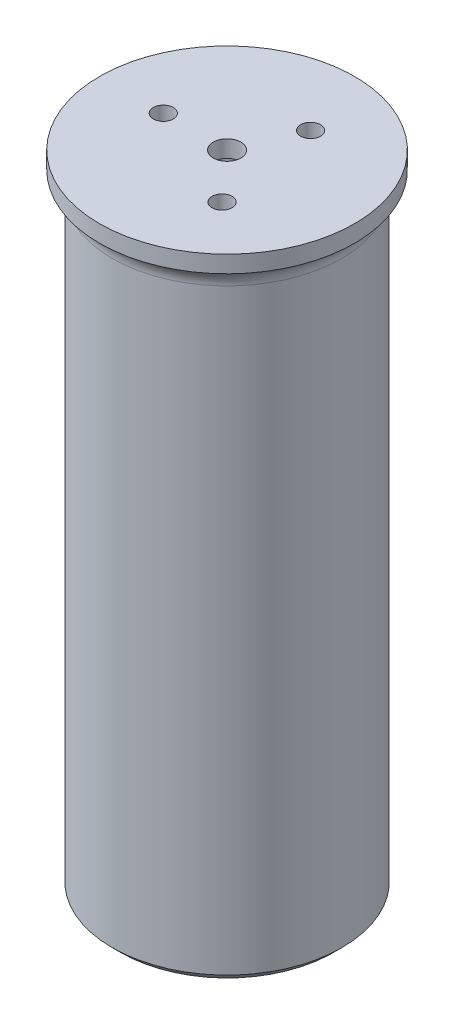
ISO-10303-21;
HEADER;
FILE_DESCRIPTION(('STEP AP214'),'2;1');
FILE_NAME('part.step','',(''),(''),'','','');
FILE_SCHEMA(('AUTOMOTIVE_DESIGN { 1 0 10303 214 1 1 1 1 }'));
ENDSEC;
DATA;
#1=APPLICATION_CONTEXT('core data for automotive mechanical design processes');
#2=APPLICATION_PROTOCOL_DEFINITION('international standard','automotive_design',2000,#1);
#3=PRODUCT_CONTEXT('',#1,'mechanical');
#4=PRODUCT('Part','Part','',(#3));
#5=PRODUCT_RELATED_PRODUCT_CATEGORY('part','',(#4));
#6=PRODUCT_DEFINITION_FORMATION('','',#4);
#7=PRODUCT_DEFINITION_CONTEXT('part definition',#1,'design');
#8=PRODUCT_DEFINITION('design','',#6,#7);
#9=PRODUCT_DEFINITION_SHAPE('','',#8);
#10=(LENGTH_UNIT() NAMED_UNIT(*) SI_UNIT(.MILLI.,.METRE.));
#11=(NAMED_UNIT(*) PLANE_ANGLE_UNIT() SI_UNIT($,.RADIAN.));
#12=(NAMED_UNIT(*) SI_UNIT($,.STERADIAN.) SOLID_ANGLE_UNIT());
#13=UNCERTAINTY_MEASURE_WITH_UNIT(LENGTH_MEASURE(1.E-05),#10,'distance_accuracy_value','');
#14=(GEOMETRIC_REPRESENTATION_CONTEXT(3) GLOBAL_UNCERTAINTY_ASSIGNED_CONTEXT((#13)) GLOBAL_UNIT_ASSIGNED_CONTEXT((#10,
#11,#12)) REPRESENTATION_CONTEXT('',''));
#15=CARTESIAN_POINT('',(0.,0.,0.));
#16=DIRECTION('',(0.,0.,1.));
#17=DIRECTION('',(1.,0.,0.));
#18=AXIS2_PLACEMENT_3D('',#15,#16,#17);
#19=CARTESIAN_POINT('',(0.,0.,0.));
#20=DIRECTION('',(0.,1.,0.));
#21=DIRECTION('',(0.,0.,1.));
#22=AXIS2_PLACEMENT_3D('',#19,#20,#21);
#23=PLANE('',#22);
#24=CARTESIAN_POINT('',(10.,0.,11.1803398874989));
#25=DIRECTION('',(0.,1.,0.));
#26=DIRECTION('',(0.,0.,1.));
#27=AXIS2_PLACEMENT_3D('',#24,#25,#26);
#28=CIRCLE('',#27,2.35);
#29=CARTESIAN_POINT('',(10.,0.,13.5303398874989));
#30=VERTEX_POINT('',#29);
#31=EDGE_CURVE('E66',#30,#30,#28,.T.);
#32=ORIENTED_EDGE('',*,*,#31,.T.);
#33=EDGE_LOOP('',(#32));
#34=FACE_BOUND('',#33,.T.);
#35=CARTESIAN_POINT('',(5.83240896842353,0.,-13.8196601125011));
#36=DIRECTION('',(0.,1.,0.));
#37=DIRECTION('',(0.,0.,1.));
#38=AXIS2_PLACEMENT_3D('',#35,#36,#37);
#39=CIRCLE('',#38,2.35);
#40=CARTESIAN_POINT('',(5.83240896842353,0.,-11.4696601125011));
#41=VERTEX_POINT('',#40);
#42=EDGE_CURVE('E60',#41,#41,#39,.T.);
#43=ORIENTED_EDGE('',*,*,#42,.T.);
#44=EDGE_LOOP('',(#43));
#45=FACE_BOUND('',#44,.T.);
#46=CARTESIAN_POINT('',(-15.,0.,0.00100327868052491));
#47=DIRECTION('',(0.,1.,0.));
#48=DIRECTION('',(0.,0.,1.));
#49=AXIS2_PLACEMENT_3D('',#46,#47,#48);
#50=CIRCLE('',#49,2.35);
#51=CARTESIAN_POINT('',(-15.,0.,2.35100327868052));
#52=VERTEX_POINT('',#51);
#53=EDGE_CURVE('E54',#52,#52,#50,.T.);
#54=ORIENTED_EDGE('',*,*,#53,.T.);
#55=EDGE_LOOP('',(#54));
#56=FACE_BOUND('',#55,.T.);
#57=CARTESIAN_POINT('',(0.,0.,0.));
#58=DIRECTION('',(0.,1.,0.));
#59=DIRECTION('',(0.,0.,1.));
#60=AXIS2_PLACEMENT_3D('',#57,#58,#59);
#61=CIRCLE('',#60,3.25);
#62=CARTESIAN_POINT('',(0.,0.,3.25));
#63=VERTEX_POINT('',#62);
#64=EDGE_CURVE('E69',#63,#63,#61,.T.);
#65=ORIENTED_EDGE('',*,*,#64,.T.);
#66=EDGE_LOOP('',(#65));
#67=FACE_BOUND('',#66,.T.);
#68=CARTESIAN_POINT('',(0.,0.,0.));
#69=DIRECTION('',(0.,-1.,0.));
#70=DIRECTION('',(0.,0.,-1.));
#71=AXIS2_PLACEMENT_3D('',#68,#69,#70);
#72=CIRCLE('',#71,25.);
#73=CARTESIAN_POINT('',(0.,0.,-25.));
#74=VERTEX_POINT('',#73);
#75=EDGE_CURVE('E75',#74,#74,#72,.T.);
#76=ORIENTED_EDGE('',*,*,#75,.T.);
#77=EDGE_LOOP('',(#76));
#78=FACE_BOUND('',#77,.T.);
#79=ADVANCED_FACE('F30',(#34,#45,#56,#67,#78),#23,.F.);
#80=CARTESIAN_POINT('',(0.,4.,0.));
#81=DIRECTION('',(0.,1.,0.));
#82=DIRECTION('',(0.,0.,1.));
#83=AXIS2_PLACEMENT_3D('',#80,#81,#82);
#84=PLANE('',#83);
#85=CARTESIAN_POINT('',(0.,4.,0.));
#86=DIRECTION('',(0.,1.,0.));
#87=DIRECTION('',(0.,0.,1.));
#88=AXIS2_PLACEMENT_3D('',#85,#86,#87);
#89=CIRCLE('',#88,3.25);
#90=CARTESIAN_POINT('',(0.,4.,3.25));
#91=VERTEX_POINT('',#90);
#92=EDGE_CURVE('E72',#91,#91,#89,.T.);
#93=ORIENTED_EDGE('',*,*,#92,.F.);
#94=EDGE_LOOP('',(#93));
#95=FACE_BOUND('',#94,.T.);
#96=CARTESIAN_POINT('',(5.83240896842353,4.,-13.8196601125011));
#97=DIRECTION('',(0.,1.,0.));
#98=DIRECTION('',(0.,0.,1.));
#99=AXIS2_PLACEMENT_3D('',#96,#97,#98);
#100=CIRCLE('',#99,2.35);
#101=CARTESIAN_POINT('',(5.83240896842353,4.,-11.4696601125011));
#102=VERTEX_POINT('',#101);
#103=EDGE_CURVE('E57',#102,#102,#100,.T.);
#104=ORIENTED_EDGE('',*,*,#103,.F.);
#105=EDGE_LOOP('',(#104));
#106=FACE_BOUND('',#105,.T.);
#107=CARTESIAN_POINT('',(0.,4.,0.));
#108=DIRECTION('',(0.,1.,0.));
#109=DIRECTION('',(0.,0.,1.));
#110=AXIS2_PLACEMENT_3D('',#107,#108,#109);
#111=CIRCLE('',#110,30.);
#112=CARTESIAN_POINT('',(0.,4.,30.));
#113=VERTEX_POINT('',#112);
#114=EDGE_CURVE('E45',#113,#113,#111,.T.);
#115=ORIENTED_EDGE('',*,*,#114,.T.);
#116=EDGE_LOOP('',(#115));
#117=FACE_BOUND('',#116,.T.);
#118=CARTESIAN_POINT('',(-15.,4.,0.00100327868052491));
#119=DIRECTION('',(0.,1.,0.));
#120=DIRECTION('',(0.,0.,1.));
#121=AXIS2_PLACEMENT_3D('',#118,#119,#120);
#122=CIRCLE('',#121,2.35);
#123=CARTESIAN_POINT('',(-15.,4.,2.35100327868052));
#124=VERTEX_POINT('',#123);
#125=EDGE_CURVE('E51',#124,#124,#122,.T.);
#126=ORIENTED_EDGE('',*,*,#125,.F.);
#127=EDGE_LOOP('',(#126));
#128=FACE_BOUND('',#127,.T.);
#129=CARTESIAN_POINT('',(10.,4.,11.1803398874989));
#130=DIRECTION('',(0.,1.,0.));
#131=DIRECTION('',(0.,0.,1.));
#132=AXIS2_PLACEMENT_3D('',#129,#130,#131);
#133=CIRCLE('',#132,2.35);
#134=CARTESIAN_POINT('',(10.,4.,13.5303398874989));
#135=VERTEX_POINT('',#134);
#136=EDGE_CURVE('E63',#135,#135,#133,.T.);
#137=ORIENTED_EDGE('',*,*,#136,.F.);
#138=EDGE_LOOP('',(#137));
#139=FACE_BOUND('',#138,.T.);
#140=ADVANCED_FACE('F96',(#95,#106,#117,#128,#139),#84,.T.);
#141=CARTESIAN_POINT('',(0.,4.,0.));
#142=DIRECTION('',(0.,-1.,0.));
#143=DIRECTION('',(0.,0.,-1.));
#144=AXIS2_PLACEMENT_3D('',#141,#142,#143);
#145=CYLINDRICAL_SURFACE('',#144,30.);
#146=ORIENTED_EDGE('',*,*,#114,.F.);
#147=EDGE_LOOP('',(#146));
#148=FACE_BOUND('',#147,.T.);
#149=CARTESIAN_POINT('',(0.,0.,0.));
#150=DIRECTION('',(0.,1.,0.));
#151=DIRECTION('',(0.,0.,1.));
#152=AXIS2_PLACEMENT_3D('',#149,#150,#151);
#153=CIRCLE('',#152,30.);
#154=CARTESIAN_POINT('',(0.,0.,30.));
#155=VERTEX_POINT('',#154);
#156=EDGE_CURVE('E48',#155,#155,#153,.T.);
#157=ORIENTED_EDGE('',*,*,#156,.T.);
#158=EDGE_LOOP('',(#157));
#159=FACE_BOUND('',#158,.T.);
#160=ADVANCED_FACE('F102',(#148,#159),#145,.T.);
#161=CARTESIAN_POINT('',(-15.,4.,0.00100327868052491));
#162=DIRECTION('',(0.,-1.,0.));
#163=DIRECTION('',(0.,0.,-1.));
#164=AXIS2_PLACEMENT_3D('',#161,#162,#163);
#165=CYLINDRICAL_SURFACE('',#164,2.35);
#166=ORIENTED_EDGE('',*,*,#125,.T.);
#167=EDGE_LOOP('',(#166));
#168=FACE_BOUND('',#167,.T.);
#169=ORIENTED_EDGE('',*,*,#53,.F.);
#170=EDGE_LOOP('',(#169));
#171=FACE_BOUND('',#170,.T.);
#172=ADVANCED_FACE('F109',(#168,#171),#165,.F.);
#173=CARTESIAN_POINT('',(5.83240896842353,4.,-13.8196601125011));
#174=DIRECTION('',(0.,-1.,0.));
#175=DIRECTION('',(0.,0.,-1.));
#176=AXIS2_PLACEMENT_3D('',#173,#174,#175);
#177=CYLINDRICAL_SURFACE('',#176,2.35);
#178=ORIENTED_EDGE('',*,*,#103,.T.);
#179=EDGE_LOOP('',(#178));
#180=FACE_BOUND('',#179,.T.);
#181=ORIENTED_EDGE('',*,*,#42,.F.);
#182=EDGE_LOOP('',(#181));
#183=FACE_BOUND('',#182,.T.);
#184=ADVANCED_FACE('F114',(#180,#183),#177,.F.);
#185=CARTESIAN_POINT('',(10.,4.,11.1803398874989));
#186=DIRECTION('',(0.,-1.,0.));
#187=DIRECTION('',(0.,0.,-1.));
#188=AXIS2_PLACEMENT_3D('',#185,#186,#187);
#189=CYLINDRICAL_SURFACE('',#188,2.35);
#190=ORIENTED_EDGE('',*,*,#136,.T.);
#191=EDGE_LOOP('',(#190));
#192=FACE_BOUND('',#191,.T.);
#193=ORIENTED_EDGE('',*,*,#31,.F.);
#194=EDGE_LOOP('',(#193));
#195=FACE_BOUND('',#194,.T.);
#196=ADVANCED_FACE('F145',(#192,#195),#189,.F.);
#197=CARTESIAN_POINT('',(0.,0.,0.));
#198=DIRECTION('',(0.,1.,0.));
#199=DIRECTION('',(0.,0.,1.));
#200=AXIS2_PLACEMENT_3D('',#197,#198,#199);
#201=CYLINDRICAL_SURFACE('',#200,3.25);
#202=ORIENTED_EDGE('',*,*,#64,.F.);
#203=EDGE_LOOP('',(#202));
#204=FACE_BOUND('',#203,.T.);
#205=ORIENTED_EDGE('',*,*,#92,.T.);
#206=EDGE_LOOP('',(#205));
#207=FACE_BOUND('',#206,.T.);
#208=ADVANCED_FACE('F93',(#204,#207),#201,.F.);
#209=CARTESIAN_POINT('',(0.,-150.,0.));
#210=DIRECTION('',(0.,1.,0.));
#211=DIRECTION('',(0.,0.,1.));
#212=AXIS2_PLACEMENT_3D('',#209,#210,#211);
#213=CYLINDRICAL_SURFACE('',#212,27.);
#214=CARTESIAN_POINT('',(0.,-4.58257569495585,0.));
#215=DIRECTION('',(0.,1.,0.));
#216=DIRECTION('',(0.,0.,1.));
#217=AXIS2_PLACEMENT_3D('',#214,#215,#216);
#218=CIRCLE('',#217,27.);
#219=CARTESIAN_POINT('',(0.,-4.58257569495585,27.));
#220=VERTEX_POINT('',#219);
#221=EDGE_CURVE('E10',#220,#220,#218,.F.);
#222=ORIENTED_EDGE('',*,*,#221,.T.);
#223=EDGE_LOOP('',(#222));
#224=FACE_BOUND('',#223,.T.);
#225=CARTESIAN_POINT('',(0.,-145.,0.));
#226=DIRECTION('',(0.,-1.,0.));
#227=DIRECTION('',(0.,0.,-1.));
#228=AXIS2_PLACEMENT_3D('',#225,#226,#227);
#229=CIRCLE('',#228,27.);
#230=CARTESIAN_POINT('',(0.,-145.,-27.));
#231=VERTEX_POINT('',#230);
#232=EDGE_CURVE('E37',#231,#231,#229,.F.);
#233=ORIENTED_EDGE('',*,*,#232,.T.);
#234=EDGE_LOOP('',(#233));
#235=FACE_BOUND('',#234,.T.);
#236=ADVANCED_FACE('F85',(#224,#235),#213,.T.);
#237=CARTESIAN_POINT('',(0.,-150.,0.));
#238=DIRECTION('',(0.,1.,0.));
#239=DIRECTION('',(0.,0.,1.));
#240=AXIS2_PLACEMENT_3D('',#237,#238,#239);
#241=CYLINDRICAL_SURFACE('',#240,25.);
#242=CARTESIAN_POINT('',(0.,-147.,0.));
#243=DIRECTION('',(0.,1.,0.));
#244=DIRECTION('',(0.,0.,1.));
#245=AXIS2_PLACEMENT_3D('',#242,#243,#244);
#246=CIRCLE('',#245,25.);
#247=CARTESIAN_POINT('',(0.,-147.,25.));
#248=VERTEX_POINT('',#247);
#249=EDGE_CURVE('E41',#248,#248,#246,.F.);
#250=ORIENTED_EDGE('',*,*,#249,.T.);
#251=EDGE_LOOP('',(#250));
#252=FACE_BOUND('',#251,.T.);
#253=ORIENTED_EDGE('',*,*,#75,.F.);
#254=EDGE_LOOP('',(#253));
#255=FACE_BOUND('',#254,.T.);
#256=ADVANCED_FACE('F82',(#252,#255),#241,.F.);
#257=CARTESIAN_POINT('',(0.,-150.,0.));
#258=DIRECTION('',(0.,1.,0.));
#259=DIRECTION('',(0.,0.,1.));
#260=AXIS2_PLACEMENT_3D('',#257,#258,#259);
#261=CONICAL_SURFACE('',#260,21.9999999999999,0.785398163397454);
#262=ORIENTED_EDGE('',*,*,#232,.F.);
#263=EDGE_LOOP('',(#262));
#264=FACE_BOUND('',#263,.T.);
#265=ORIENTED_EDGE('',*,*,#249,.F.);
#266=EDGE_LOOP('',(#265));
#267=FACE_BOUND('',#266,.T.);
#268=ADVANCED_FACE('F84',(#264,#267),#261,.T.);
#269=CARTESIAN_POINT('',(0.,-4.58257569495584,0.));
#270=DIRECTION('',(0.,1.,0.));
#271=DIRECTION('',(0.,0.,1.));
#272=AXIS2_PLACEMENT_3D('',#269,#270,#271);
#273=TOROIDAL_SURFACE('',#272,32.,5.);
#274=ORIENTED_EDGE('',*,*,#156,.F.);
#275=EDGE_LOOP('',(#274));
#276=FACE_BOUND('',#275,.T.);
#277=ORIENTED_EDGE('',*,*,#221,.F.);
#278=EDGE_LOOP('',(#277));
#279=FACE_BOUND('',#278,.T.);
#280=ADVANCED_FACE('F32',(#276,#279),#273,.F.);
#281=CLOSED_SHELL('',(#79,#140,#160,#172,#184,#196,#208,#236,#256,#268,#280));
#282=MANIFOLD_SOLID_BREP('B2',#281);
#283=ADVANCED_BREP_SHAPE_REPRESENTATION('',(#18,#282),#14);
#284=SHAPE_DEFINITION_REPRESENTATION(#9,#283);
ENDSEC;
END-ISO-10303-21;
